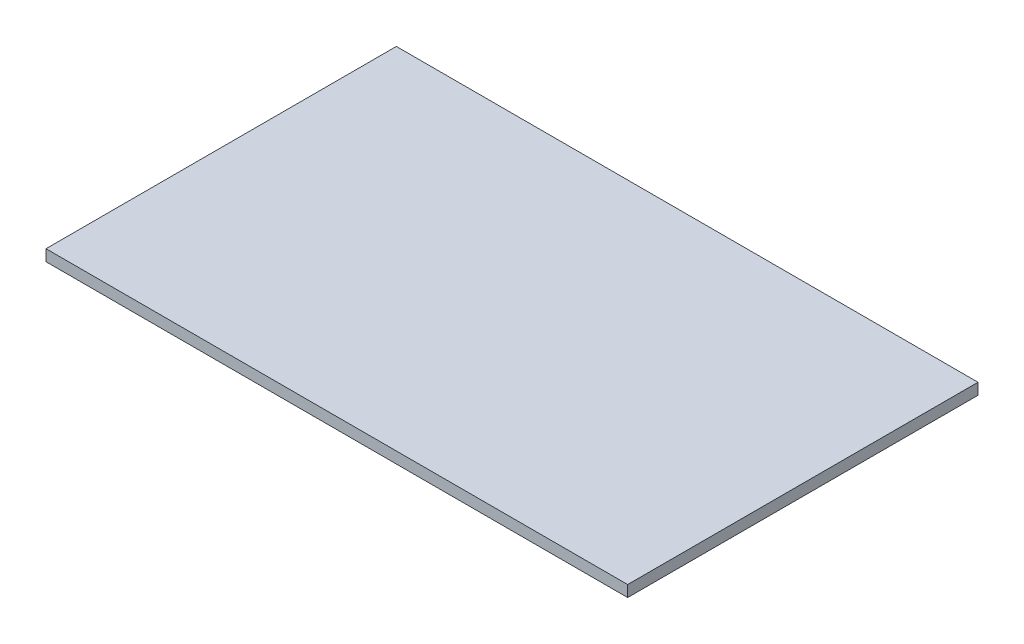
ISO-10303-21;
HEADER;
FILE_DESCRIPTION(('STEP AP214'),'2;1');
FILE_NAME('part.step','',(''),(''),'','','');
FILE_SCHEMA(('AUTOMOTIVE_DESIGN { 1 0 10303 214 1 1 1 1 }'));
ENDSEC;
DATA;
#1=APPLICATION_CONTEXT('core data for automotive mechanical design processes');
#2=APPLICATION_PROTOCOL_DEFINITION('international standard','automotive_design',2000,#1);
#3=PRODUCT_CONTEXT('',#1,'mechanical');
#4=PRODUCT('Part','Part','',(#3));
#5=PRODUCT_RELATED_PRODUCT_CATEGORY('part','',(#4));
#6=PRODUCT_DEFINITION_FORMATION('','',#4);
#7=PRODUCT_DEFINITION_CONTEXT('part definition',#1,'design');
#8=PRODUCT_DEFINITION('design','',#6,#7);
#9=PRODUCT_DEFINITION_SHAPE('','',#8);
#10=(LENGTH_UNIT() NAMED_UNIT(*) SI_UNIT(.MILLI.,.METRE.));
#11=(NAMED_UNIT(*) PLANE_ANGLE_UNIT() SI_UNIT($,.RADIAN.));
#12=(NAMED_UNIT(*) SI_UNIT($,.STERADIAN.) SOLID_ANGLE_UNIT());
#13=UNCERTAINTY_MEASURE_WITH_UNIT(LENGTH_MEASURE(1.E-05),#10,'distance_accuracy_value','');
#14=(GEOMETRIC_REPRESENTATION_CONTEXT(3) GLOBAL_UNCERTAINTY_ASSIGNED_CONTEXT((#13)) GLOBAL_UNIT_ASSIGNED_CONTEXT((#10,
#11,#12)) REPRESENTATION_CONTEXT('',''));
#15=CARTESIAN_POINT('',(0.,0.,0.));
#16=DIRECTION('',(0.,0.,1.));
#17=DIRECTION('',(1.,0.,0.));
#18=AXIS2_PLACEMENT_3D('',#15,#16,#17);
#19=CARTESIAN_POINT('',(51.5,0.,-31.02));
#20=DIRECTION('',(-1.,0.,0.));
#21=DIRECTION('',(0.,0.,1.));
#22=AXIS2_PLACEMENT_3D('',#19,#20,#21);
#23=PLANE('',#22);
#24=DIRECTION('',(0.,1.,0.));
#25=VECTOR('',#24,1.);
#26=CARTESIAN_POINT('',(51.5,1.,-31.02));
#27=LINE('',#26,#25);
#28=CARTESIAN_POINT('',(51.5,0.,-31.02));
#29=VERTEX_POINT('',#28);
#30=CARTESIAN_POINT('',(51.5,2.,-31.02));
#31=VERTEX_POINT('',#30);
#32=EDGE_CURVE('E82',#29,#31,#27,.T.);
#33=ORIENTED_EDGE('',*,*,#32,.T.);
#34=DIRECTION('',(0.,0.,1.));
#35=VECTOR('',#34,1.);
#36=CARTESIAN_POINT('',(51.5,2.,0.));
#37=LINE('',#36,#35);
#38=CARTESIAN_POINT('',(51.5,2.,31.02));
#39=VERTEX_POINT('',#38);
#40=EDGE_CURVE('E100',#31,#39,#37,.T.);
#41=ORIENTED_EDGE('',*,*,#40,.T.);
#42=DIRECTION('',(0.,-1.,0.));
#43=VECTOR('',#42,1.);
#44=CARTESIAN_POINT('',(51.5,1.,31.02));
#45=LINE('',#44,#43);
#46=CARTESIAN_POINT('',(51.5,0.,31.02));
#47=VERTEX_POINT('',#46);
#48=EDGE_CURVE('E39',#39,#47,#45,.T.);
#49=ORIENTED_EDGE('',*,*,#48,.T.);
#50=DIRECTION('',(0.,0.,1.));
#51=VECTOR('',#50,1.);
#52=CARTESIAN_POINT('',(51.5,0.,0.));
#53=LINE('',#52,#51);
#54=EDGE_CURVE('E101',#29,#47,#53,.T.);
#55=ORIENTED_EDGE('',*,*,#54,.F.);
#56=EDGE_LOOP('',(#33,#41,#49,#55));
#57=FACE_BOUND('',#56,.T.);
#58=ADVANCED_FACE('F35',(#57),#23,.F.);
#59=CARTESIAN_POINT('',(51.5,0.,31.02));
#60=DIRECTION('',(0.,0.,-1.));
#61=DIRECTION('',(-1.,0.,0.));
#62=AXIS2_PLACEMENT_3D('',#59,#60,#61);
#63=PLANE('',#62);
#64=ORIENTED_EDGE('',*,*,#48,.F.);
#65=DIRECTION('',(-1.,0.,0.));
#66=VECTOR('',#65,1.);
#67=CARTESIAN_POINT('',(0.,2.,31.02));
#68=LINE('',#67,#66);
#69=CARTESIAN_POINT('',(-51.5,2.,31.02));
#70=VERTEX_POINT('',#69);
#71=EDGE_CURVE('E87',#39,#70,#68,.T.);
#72=ORIENTED_EDGE('',*,*,#71,.T.);
#73=DIRECTION('',(0.,-1.,0.));
#74=VECTOR('',#73,1.);
#75=CARTESIAN_POINT('',(-51.5,1.,31.02));
#76=LINE('',#75,#74);
#77=CARTESIAN_POINT('',(-51.5,0.,31.02));
#78=VERTEX_POINT('',#77);
#79=EDGE_CURVE('E78',#70,#78,#76,.T.);
#80=ORIENTED_EDGE('',*,*,#79,.T.);
#81=DIRECTION('',(-1.,0.,0.));
#82=VECTOR('',#81,1.);
#83=CARTESIAN_POINT('',(0.,0.,31.02));
#84=LINE('',#83,#82);
#85=EDGE_CURVE('E108',#47,#78,#84,.T.);
#86=ORIENTED_EDGE('',*,*,#85,.F.);
#87=EDGE_LOOP('',(#64,#72,#80,#86));
#88=FACE_BOUND('',#87,.T.);
#89=ADVANCED_FACE('F92',(#88),#63,.F.);
#90=CARTESIAN_POINT('',(-51.5,0.,31.02));
#91=DIRECTION('',(1.,0.,0.));
#92=DIRECTION('',(0.,0.,-1.));
#93=AXIS2_PLACEMENT_3D('',#90,#91,#92);
#94=PLANE('',#93);
#95=ORIENTED_EDGE('',*,*,#79,.F.);
#96=DIRECTION('',(0.,0.,-1.));
#97=VECTOR('',#96,1.);
#98=CARTESIAN_POINT('',(-51.5,2.,0.));
#99=LINE('',#98,#97);
#100=CARTESIAN_POINT('',(-51.5,2.,-31.02));
#101=VERTEX_POINT('',#100);
#102=EDGE_CURVE('E81',#70,#101,#99,.T.);
#103=ORIENTED_EDGE('',*,*,#102,.T.);
#104=DIRECTION('',(0.,-1.,0.));
#105=VECTOR('',#104,1.);
#106=CARTESIAN_POINT('',(-51.5,1.,-31.02));
#107=LINE('',#106,#105);
#108=CARTESIAN_POINT('',(-51.5,0.,-31.02));
#109=VERTEX_POINT('',#108);
#110=EDGE_CURVE('E93',#101,#109,#107,.T.);
#111=ORIENTED_EDGE('',*,*,#110,.T.);
#112=DIRECTION('',(0.,0.,-1.));
#113=VECTOR('',#112,1.);
#114=CARTESIAN_POINT('',(-51.5,0.,0.));
#115=LINE('',#114,#113);
#116=EDGE_CURVE('E45',#78,#109,#115,.T.);
#117=ORIENTED_EDGE('',*,*,#116,.F.);
#118=EDGE_LOOP('',(#95,#103,#111,#117));
#119=FACE_BOUND('',#118,.T.);
#120=ADVANCED_FACE('F80',(#119),#94,.F.);
#121=CARTESIAN_POINT('',(-51.5,0.,-31.02));
#122=DIRECTION('',(0.,0.,1.));
#123=DIRECTION('',(1.,0.,0.));
#124=AXIS2_PLACEMENT_3D('',#121,#122,#123);
#125=PLANE('',#124);
#126=ORIENTED_EDGE('',*,*,#110,.F.);
#127=DIRECTION('',(1.,0.,0.));
#128=VECTOR('',#127,1.);
#129=CARTESIAN_POINT('',(0.,2.,-31.02));
#130=LINE('',#129,#128);
#131=EDGE_CURVE('E90',#101,#31,#130,.T.);
#132=ORIENTED_EDGE('',*,*,#131,.T.);
#133=ORIENTED_EDGE('',*,*,#32,.F.);
#134=DIRECTION('',(1.,0.,0.));
#135=VECTOR('',#134,1.);
#136=CARTESIAN_POINT('',(0.,0.,-31.02));
#137=LINE('',#136,#135);
#138=EDGE_CURVE('E11',#109,#29,#137,.T.);
#139=ORIENTED_EDGE('',*,*,#138,.F.);
#140=EDGE_LOOP('',(#126,#132,#133,#139));
#141=FACE_BOUND('',#140,.T.);
#142=ADVANCED_FACE('F105',(#141),#125,.F.);
#143=CARTESIAN_POINT('',(-51.5,2.,31.02));
#144=DIRECTION('',(0.,-1.,0.));
#145=DIRECTION('',(0.,0.,-1.));
#146=AXIS2_PLACEMENT_3D('',#143,#144,#145);
#147=PLANE('',#146);
#148=ORIENTED_EDGE('',*,*,#131,.F.);
#149=ORIENTED_EDGE('',*,*,#102,.F.);
#150=ORIENTED_EDGE('',*,*,#71,.F.);
#151=ORIENTED_EDGE('',*,*,#40,.F.);
#152=EDGE_LOOP('',(#148,#149,#150,#151));
#153=FACE_BOUND('',#152,.T.);
#154=ADVANCED_FACE('F85',(#153),#147,.F.);
#155=CARTESIAN_POINT('',(-51.5,0.,31.02));
#156=DIRECTION('',(0.,-1.,0.));
#157=DIRECTION('',(0.,0.,-1.));
#158=AXIS2_PLACEMENT_3D('',#155,#156,#157);
#159=PLANE('',#158);
#160=ORIENTED_EDGE('',*,*,#116,.T.);
#161=ORIENTED_EDGE('',*,*,#138,.T.);
#162=ORIENTED_EDGE('',*,*,#54,.T.);
#163=ORIENTED_EDGE('',*,*,#85,.T.);
#164=EDGE_LOOP('',(#160,#161,#162,#163));
#165=FACE_BOUND('',#164,.T.);
#166=ADVANCED_FACE('F37',(#165),#159,.T.);
#167=CLOSED_SHELL('',(#58,#89,#120,#142,#154,#166));
#168=MANIFOLD_SOLID_BREP('B2',#167);
#169=ADVANCED_BREP_SHAPE_REPRESENTATION('',(#18,#168),#14);
#170=SHAPE_DEFINITION_REPRESENTATION(#9,#169);
ENDSEC;
END-ISO-10303-21;
